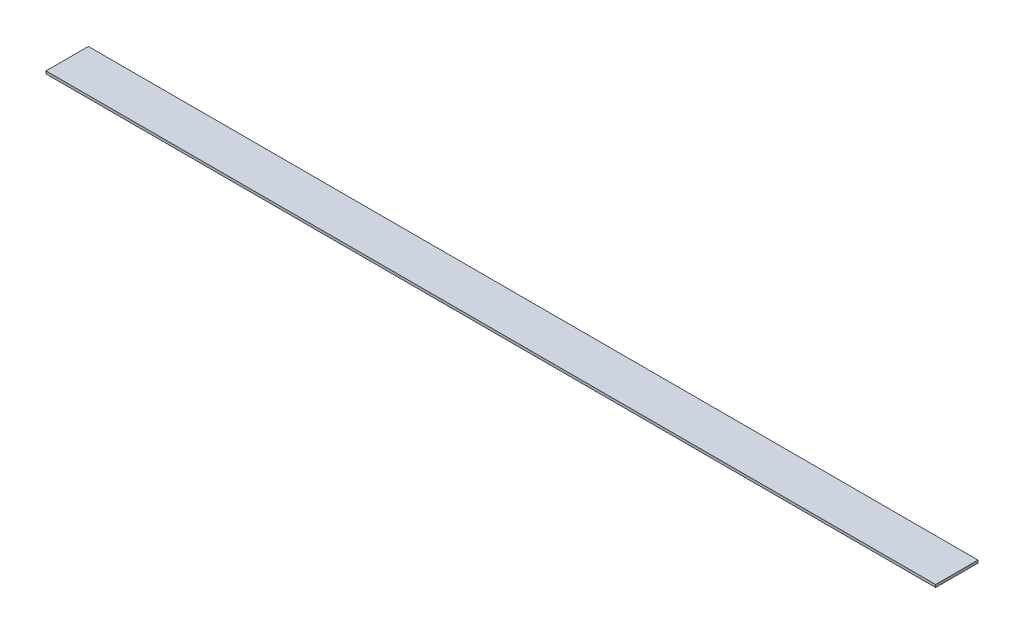
ISO-10303-21;
HEADER;
FILE_DESCRIPTION(('STEP AP214'),'2;1');
FILE_NAME('part.step','',(''),(''),'','','');
FILE_SCHEMA(('AUTOMOTIVE_DESIGN { 1 0 10303 214 1 1 1 1 }'));
ENDSEC;
DATA;
#1=APPLICATION_CONTEXT('core data for automotive mechanical design processes');
#2=APPLICATION_PROTOCOL_DEFINITION('international standard','automotive_design',2000,#1);
#3=PRODUCT_CONTEXT('',#1,'mechanical');
#4=PRODUCT('Part','Part','',(#3));
#5=PRODUCT_RELATED_PRODUCT_CATEGORY('part','',(#4));
#6=PRODUCT_DEFINITION_FORMATION('','',#4);
#7=PRODUCT_DEFINITION_CONTEXT('part definition',#1,'design');
#8=PRODUCT_DEFINITION('design','',#6,#7);
#9=PRODUCT_DEFINITION_SHAPE('','',#8);
#10=(LENGTH_UNIT() NAMED_UNIT(*) SI_UNIT(.MILLI.,.METRE.));
#11=(NAMED_UNIT(*) PLANE_ANGLE_UNIT() SI_UNIT($,.RADIAN.));
#12=(NAMED_UNIT(*) SI_UNIT($,.STERADIAN.) SOLID_ANGLE_UNIT());
#13=UNCERTAINTY_MEASURE_WITH_UNIT(LENGTH_MEASURE(1.E-05),#10,'distance_accuracy_value','');
#14=(GEOMETRIC_REPRESENTATION_CONTEXT(3) GLOBAL_UNCERTAINTY_ASSIGNED_CONTEXT((#13)) GLOBAL_UNIT_ASSIGNED_CONTEXT((#10,
#11,#12)) REPRESENTATION_CONTEXT('',''));
#15=CARTESIAN_POINT('',(0.,0.,0.));
#16=DIRECTION('',(0.,0.,1.));
#17=DIRECTION('',(1.,0.,0.));
#18=AXIS2_PLACEMENT_3D('',#15,#16,#17);
#19=CARTESIAN_POINT('',(0.,1.5875,0.));
#20=DIRECTION('',(1.,0.,0.));
#21=DIRECTION('',(0.,0.,-1.));
#22=AXIS2_PLACEMENT_3D('',#19,#20,#21);
#23=PLANE('',#22);
#24=DIRECTION('',(0.,0.,1.));
#25=VECTOR('',#24,1.);
#26=CARTESIAN_POINT('',(0.,0.,0.));
#27=LINE('',#26,#25);
#28=CARTESIAN_POINT('',(0.,0.,-25.4));
#29=VERTEX_POINT('',#28);
#30=CARTESIAN_POINT('',(0.,0.,0.));
#31=VERTEX_POINT('',#30);
#32=EDGE_CURVE('E95',#29,#31,#27,.T.);
#33=ORIENTED_EDGE('',*,*,#32,.T.);
#34=DIRECTION('',(0.,-1.,0.));
#35=VECTOR('',#34,1.);
#36=CARTESIAN_POINT('',(0.,1.5875,0.));
#37=LINE('',#36,#35);
#38=CARTESIAN_POINT('',(0.,1.5875,0.));
#39=VERTEX_POINT('',#38);
#40=EDGE_CURVE('E11',#39,#31,#37,.T.);
#41=ORIENTED_EDGE('',*,*,#40,.F.);
#42=DIRECTION('',(0.,0.,1.));
#43=VECTOR('',#42,1.);
#44=CARTESIAN_POINT('',(0.,1.5875,0.));
#45=LINE('',#44,#43);
#46=CARTESIAN_POINT('',(0.,1.5875,-25.4));
#47=VERTEX_POINT('',#46);
#48=EDGE_CURVE('E83',#47,#39,#45,.T.);
#49=ORIENTED_EDGE('',*,*,#48,.F.);
#50=DIRECTION('',(0.,-1.,0.));
#51=VECTOR('',#50,1.);
#52=CARTESIAN_POINT('',(0.,1.5875,-25.4));
#53=LINE('',#52,#51);
#54=EDGE_CURVE('E91',#47,#29,#53,.T.);
#55=ORIENTED_EDGE('',*,*,#54,.T.);
#56=EDGE_LOOP('',(#33,#41,#49,#55));
#57=FACE_BOUND('',#56,.T.);
#58=ADVANCED_FACE('F32',(#57),#23,.F.);
#59=CARTESIAN_POINT('',(0.,1.5875,0.));
#60=DIRECTION('',(0.,0.,-1.));
#61=DIRECTION('',(-1.,0.,0.));
#62=AXIS2_PLACEMENT_3D('',#59,#60,#61);
#63=PLANE('',#62);
#64=DIRECTION('',(1.,0.,0.));
#65=VECTOR('',#64,1.);
#66=CARTESIAN_POINT('',(0.,0.,0.));
#67=LINE('',#66,#65);
#68=CARTESIAN_POINT('',(533.4,0.,0.));
#69=VERTEX_POINT('',#68);
#70=EDGE_CURVE('E87',#31,#69,#67,.T.);
#71=ORIENTED_EDGE('',*,*,#70,.T.);
#72=DIRECTION('',(0.,-1.,0.));
#73=VECTOR('',#72,1.);
#74=CARTESIAN_POINT('',(533.4,1.5875,0.));
#75=LINE('',#74,#73);
#76=CARTESIAN_POINT('',(533.4,1.5875,0.));
#77=VERTEX_POINT('',#76);
#78=EDGE_CURVE('E40',#77,#69,#75,.T.);
#79=ORIENTED_EDGE('',*,*,#78,.F.);
#80=DIRECTION('',(1.,0.,0.));
#81=VECTOR('',#80,1.);
#82=CARTESIAN_POINT('',(0.,1.5875,0.));
#83=LINE('',#82,#81);
#84=EDGE_CURVE('E78',#39,#77,#83,.T.);
#85=ORIENTED_EDGE('',*,*,#84,.F.);
#86=ORIENTED_EDGE('',*,*,#40,.T.);
#87=EDGE_LOOP('',(#71,#79,#85,#86));
#88=FACE_BOUND('',#87,.T.);
#89=ADVANCED_FACE('F86',(#88),#63,.F.);
#90=CARTESIAN_POINT('',(533.4,1.5875,0.));
#91=DIRECTION('',(-1.,0.,0.));
#92=DIRECTION('',(0.,0.,1.));
#93=AXIS2_PLACEMENT_3D('',#90,#91,#92);
#94=PLANE('',#93);
#95=DIRECTION('',(0.,0.,-1.));
#96=VECTOR('',#95,1.);
#97=CARTESIAN_POINT('',(533.4,0.,0.));
#98=LINE('',#97,#96);
#99=CARTESIAN_POINT('',(533.4,0.,-25.4));
#100=VERTEX_POINT('',#99);
#101=EDGE_CURVE('E65',#69,#100,#98,.T.);
#102=ORIENTED_EDGE('',*,*,#101,.T.);
#103=DIRECTION('',(0.,-1.,0.));
#104=VECTOR('',#103,1.);
#105=CARTESIAN_POINT('',(533.4,1.5875,-25.4));
#106=LINE('',#105,#104);
#107=CARTESIAN_POINT('',(533.4,1.5875,-25.4));
#108=VERTEX_POINT('',#107);
#109=EDGE_CURVE('E88',#108,#100,#106,.T.);
#110=ORIENTED_EDGE('',*,*,#109,.F.);
#111=DIRECTION('',(0.,0.,-1.));
#112=VECTOR('',#111,1.);
#113=CARTESIAN_POINT('',(533.4,1.5875,0.));
#114=LINE('',#113,#112);
#115=EDGE_CURVE('E81',#77,#108,#114,.T.);
#116=ORIENTED_EDGE('',*,*,#115,.F.);
#117=ORIENTED_EDGE('',*,*,#78,.T.);
#118=EDGE_LOOP('',(#102,#110,#116,#117));
#119=FACE_BOUND('',#118,.T.);
#120=ADVANCED_FACE('F89',(#119),#94,.F.);
#121=CARTESIAN_POINT('',(0.,1.5875,-25.4));
#122=DIRECTION('',(0.,0.,1.));
#123=DIRECTION('',(1.,0.,0.));
#124=AXIS2_PLACEMENT_3D('',#121,#122,#123);
#125=PLANE('',#124);
#126=DIRECTION('',(-1.,0.,0.));
#127=VECTOR('',#126,1.);
#128=CARTESIAN_POINT('',(0.,0.,-25.4));
#129=LINE('',#128,#127);
#130=EDGE_CURVE('E71',#100,#29,#129,.T.);
#131=ORIENTED_EDGE('',*,*,#130,.T.);
#132=ORIENTED_EDGE('',*,*,#54,.F.);
#133=DIRECTION('',(-1.,0.,0.));
#134=VECTOR('',#133,1.);
#135=CARTESIAN_POINT('',(0.,1.5875,-25.4));
#136=LINE('',#135,#134);
#137=EDGE_CURVE('E48',#108,#47,#136,.T.);
#138=ORIENTED_EDGE('',*,*,#137,.F.);
#139=ORIENTED_EDGE('',*,*,#109,.T.);
#140=EDGE_LOOP('',(#131,#132,#138,#139));
#141=FACE_BOUND('',#140,.T.);
#142=ADVANCED_FACE('F102',(#141),#125,.F.);
#143=CARTESIAN_POINT('',(0.,1.5875,0.));
#144=DIRECTION('',(0.,-1.,0.));
#145=DIRECTION('',(0.,0.,-1.));
#146=AXIS2_PLACEMENT_3D('',#143,#144,#145);
#147=PLANE('',#146);
#148=ORIENTED_EDGE('',*,*,#48,.T.);
#149=ORIENTED_EDGE('',*,*,#84,.T.);
#150=ORIENTED_EDGE('',*,*,#115,.T.);
#151=ORIENTED_EDGE('',*,*,#137,.T.);
#152=EDGE_LOOP('',(#148,#149,#150,#151));
#153=FACE_BOUND('',#152,.T.);
#154=ADVANCED_FACE('F79',(#153),#147,.F.);
#155=CARTESIAN_POINT('',(0.,0.,0.));
#156=DIRECTION('',(0.,-1.,0.));
#157=DIRECTION('',(0.,0.,-1.));
#158=AXIS2_PLACEMENT_3D('',#155,#156,#157);
#159=PLANE('',#158);
#160=ORIENTED_EDGE('',*,*,#32,.F.);
#161=ORIENTED_EDGE('',*,*,#130,.F.);
#162=ORIENTED_EDGE('',*,*,#101,.F.);
#163=ORIENTED_EDGE('',*,*,#70,.F.);
#164=EDGE_LOOP('',(#160,#161,#162,#163));
#165=FACE_BOUND('',#164,.T.);
#166=ADVANCED_FACE('F105',(#165),#159,.T.);
#167=CLOSED_SHELL('',(#58,#89,#120,#142,#154,#166));
#168=MANIFOLD_SOLID_BREP('B2',#167);
#169=ADVANCED_BREP_SHAPE_REPRESENTATION('',(#18,#168),#14);
#170=SHAPE_DEFINITION_REPRESENTATION(#9,#169);
ENDSEC;
END-ISO-10303-21;
